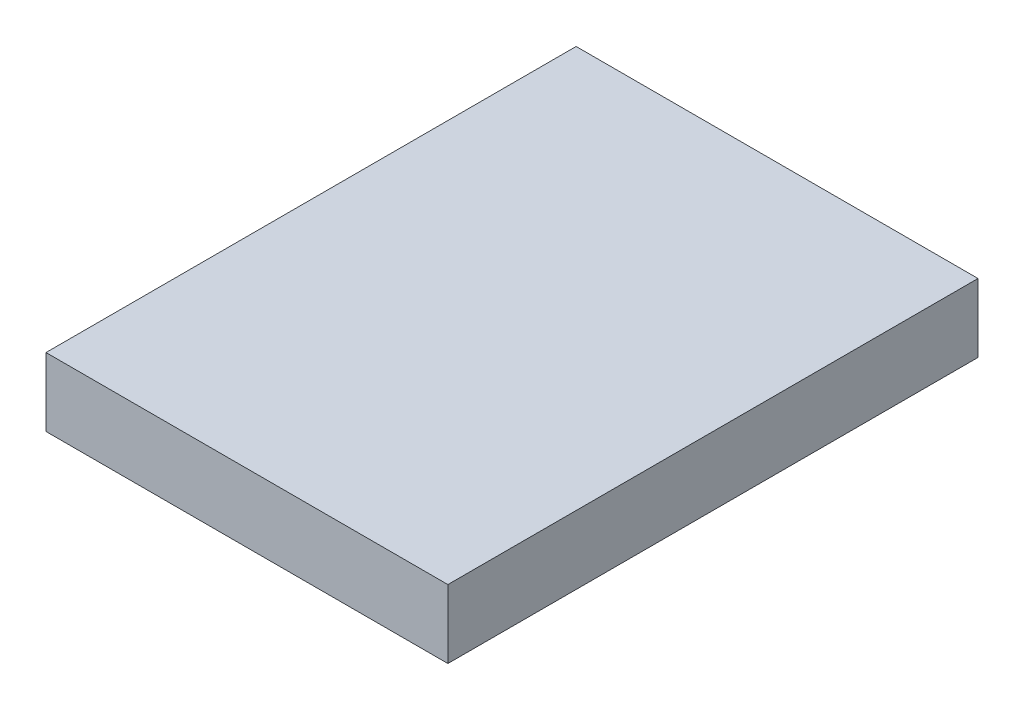
ISO-10303-21;
HEADER;
FILE_DESCRIPTION(('STEP AP214'),'2;1');
FILE_NAME('part.step','',(''),(''),'','','');
FILE_SCHEMA(('AUTOMOTIVE_DESIGN { 1 0 10303 214 1 1 1 1 }'));
ENDSEC;
DATA;
#1=APPLICATION_CONTEXT('core data for automotive mechanical design processes');
#2=APPLICATION_PROTOCOL_DEFINITION('international standard','automotive_design',2000,#1);
#3=PRODUCT_CONTEXT('',#1,'mechanical');
#4=PRODUCT('Part','Part','',(#3));
#5=PRODUCT_RELATED_PRODUCT_CATEGORY('part','',(#4));
#6=PRODUCT_DEFINITION_FORMATION('','',#4);
#7=PRODUCT_DEFINITION_CONTEXT('part definition',#1,'design');
#8=PRODUCT_DEFINITION('design','',#6,#7);
#9=PRODUCT_DEFINITION_SHAPE('','',#8);
#10=(LENGTH_UNIT() NAMED_UNIT(*) SI_UNIT(.MILLI.,.METRE.));
#11=(NAMED_UNIT(*) PLANE_ANGLE_UNIT() SI_UNIT($,.RADIAN.));
#12=(NAMED_UNIT(*) SI_UNIT($,.STERADIAN.) SOLID_ANGLE_UNIT());
#13=UNCERTAINTY_MEASURE_WITH_UNIT(LENGTH_MEASURE(1.E-05),#10,'distance_accuracy_value','');
#14=(GEOMETRIC_REPRESENTATION_CONTEXT(3) GLOBAL_UNCERTAINTY_ASSIGNED_CONTEXT((#13)) GLOBAL_UNIT_ASSIGNED_CONTEXT((#10,
#11,#12)) REPRESENTATION_CONTEXT('',''));
#15=CARTESIAN_POINT('',(0.,0.,0.));
#16=DIRECTION('',(0.,0.,1.));
#17=DIRECTION('',(1.,0.,0.));
#18=AXIS2_PLACEMENT_3D('',#15,#16,#17);
#19=CARTESIAN_POINT('',(0.,8.,0.));
#20=DIRECTION('',(1.,0.,0.));
#21=DIRECTION('',(0.,0.,-1.));
#22=AXIS2_PLACEMENT_3D('',#19,#20,#21);
#23=PLANE('',#22);
#24=DIRECTION('',(0.,0.,1.));
#25=VECTOR('',#24,1.);
#26=CARTESIAN_POINT('',(0.,0.,0.));
#27=LINE('',#26,#25);
#28=CARTESIAN_POINT('',(0.,0.,-62.));
#29=VERTEX_POINT('',#28);
#30=CARTESIAN_POINT('',(0.,0.,0.));
#31=VERTEX_POINT('',#30);
#32=EDGE_CURVE('E96',#29,#31,#27,.T.);
#33=ORIENTED_EDGE('',*,*,#32,.T.);
#34=DIRECTION('',(0.,-1.,0.));
#35=VECTOR('',#34,1.);
#36=CARTESIAN_POINT('',(0.,8.,0.));
#37=LINE('',#36,#35);
#38=CARTESIAN_POINT('',(0.,8.,0.));
#39=VERTEX_POINT('',#38);
#40=EDGE_CURVE('E11',#39,#31,#37,.T.);
#41=ORIENTED_EDGE('',*,*,#40,.F.);
#42=DIRECTION('',(0.,0.,1.));
#43=VECTOR('',#42,1.);
#44=CARTESIAN_POINT('',(0.,8.,0.));
#45=LINE('',#44,#43);
#46=CARTESIAN_POINT('',(0.,8.,-62.));
#47=VERTEX_POINT('',#46);
#48=EDGE_CURVE('E84',#47,#39,#45,.T.);
#49=ORIENTED_EDGE('',*,*,#48,.F.);
#50=DIRECTION('',(0.,-1.,0.));
#51=VECTOR('',#50,1.);
#52=CARTESIAN_POINT('',(0.,8.,-62.));
#53=LINE('',#52,#51);
#54=EDGE_CURVE('E92',#47,#29,#53,.T.);
#55=ORIENTED_EDGE('',*,*,#54,.T.);
#56=EDGE_LOOP('',(#33,#41,#49,#55));
#57=FACE_BOUND('',#56,.T.);
#58=ADVANCED_FACE('F33',(#57),#23,.F.);
#59=CARTESIAN_POINT('',(0.,8.,0.));
#60=DIRECTION('',(0.,0.,-1.));
#61=DIRECTION('',(-1.,0.,0.));
#62=AXIS2_PLACEMENT_3D('',#59,#60,#61);
#63=PLANE('',#62);
#64=DIRECTION('',(1.,0.,0.));
#65=VECTOR('',#64,1.);
#66=CARTESIAN_POINT('',(0.,0.,0.));
#67=LINE('',#66,#65);
#68=CARTESIAN_POINT('',(47.,0.,0.));
#69=VERTEX_POINT('',#68);
#70=EDGE_CURVE('E88',#31,#69,#67,.T.);
#71=ORIENTED_EDGE('',*,*,#70,.T.);
#72=DIRECTION('',(0.,-1.,0.));
#73=VECTOR('',#72,1.);
#74=CARTESIAN_POINT('',(47.,8.,0.));
#75=LINE('',#74,#73);
#76=CARTESIAN_POINT('',(47.,8.,0.));
#77=VERTEX_POINT('',#76);
#78=EDGE_CURVE('E41',#77,#69,#75,.T.);
#79=ORIENTED_EDGE('',*,*,#78,.F.);
#80=DIRECTION('',(1.,0.,0.));
#81=VECTOR('',#80,1.);
#82=CARTESIAN_POINT('',(0.,8.,0.));
#83=LINE('',#82,#81);
#84=EDGE_CURVE('E79',#39,#77,#83,.T.);
#85=ORIENTED_EDGE('',*,*,#84,.F.);
#86=ORIENTED_EDGE('',*,*,#40,.T.);
#87=EDGE_LOOP('',(#71,#79,#85,#86));
#88=FACE_BOUND('',#87,.T.);
#89=ADVANCED_FACE('F87',(#88),#63,.F.);
#90=CARTESIAN_POINT('',(47.,8.,0.));
#91=DIRECTION('',(-1.,0.,0.));
#92=DIRECTION('',(0.,0.,1.));
#93=AXIS2_PLACEMENT_3D('',#90,#91,#92);
#94=PLANE('',#93);
#95=DIRECTION('',(0.,0.,-1.));
#96=VECTOR('',#95,1.);
#97=CARTESIAN_POINT('',(47.,0.,0.));
#98=LINE('',#97,#96);
#99=CARTESIAN_POINT('',(47.,0.,-62.));
#100=VERTEX_POINT('',#99);
#101=EDGE_CURVE('E66',#69,#100,#98,.T.);
#102=ORIENTED_EDGE('',*,*,#101,.T.);
#103=DIRECTION('',(0.,-1.,0.));
#104=VECTOR('',#103,1.);
#105=CARTESIAN_POINT('',(47.,8.,-62.));
#106=LINE('',#105,#104);
#107=CARTESIAN_POINT('',(47.,8.,-62.));
#108=VERTEX_POINT('',#107);
#109=EDGE_CURVE('E89',#108,#100,#106,.T.);
#110=ORIENTED_EDGE('',*,*,#109,.F.);
#111=DIRECTION('',(0.,0.,-1.));
#112=VECTOR('',#111,1.);
#113=CARTESIAN_POINT('',(47.,8.,0.));
#114=LINE('',#113,#112);
#115=EDGE_CURVE('E82',#77,#108,#114,.T.);
#116=ORIENTED_EDGE('',*,*,#115,.F.);
#117=ORIENTED_EDGE('',*,*,#78,.T.);
#118=EDGE_LOOP('',(#102,#110,#116,#117));
#119=FACE_BOUND('',#118,.T.);
#120=ADVANCED_FACE('F90',(#119),#94,.F.);
#121=CARTESIAN_POINT('',(0.,8.,-62.));
#122=DIRECTION('',(0.,0.,1.));
#123=DIRECTION('',(1.,0.,0.));
#124=AXIS2_PLACEMENT_3D('',#121,#122,#123);
#125=PLANE('',#124);
#126=DIRECTION('',(-1.,0.,0.));
#127=VECTOR('',#126,1.);
#128=CARTESIAN_POINT('',(0.,0.,-62.));
#129=LINE('',#128,#127);
#130=EDGE_CURVE('E72',#100,#29,#129,.T.);
#131=ORIENTED_EDGE('',*,*,#130,.T.);
#132=ORIENTED_EDGE('',*,*,#54,.F.);
#133=DIRECTION('',(-1.,0.,0.));
#134=VECTOR('',#133,1.);
#135=CARTESIAN_POINT('',(0.,8.,-62.));
#136=LINE('',#135,#134);
#137=EDGE_CURVE('E49',#108,#47,#136,.T.);
#138=ORIENTED_EDGE('',*,*,#137,.F.);
#139=ORIENTED_EDGE('',*,*,#109,.T.);
#140=EDGE_LOOP('',(#131,#132,#138,#139));
#141=FACE_BOUND('',#140,.T.);
#142=ADVANCED_FACE('F103',(#141),#125,.F.);
#143=CARTESIAN_POINT('',(0.,8.,0.));
#144=DIRECTION('',(0.,-1.,0.));
#145=DIRECTION('',(0.,0.,-1.));
#146=AXIS2_PLACEMENT_3D('',#143,#144,#145);
#147=PLANE('',#146);
#148=ORIENTED_EDGE('',*,*,#48,.T.);
#149=ORIENTED_EDGE('',*,*,#84,.T.);
#150=ORIENTED_EDGE('',*,*,#115,.T.);
#151=ORIENTED_EDGE('',*,*,#137,.T.);
#152=EDGE_LOOP('',(#148,#149,#150,#151));
#153=FACE_BOUND('',#152,.T.);
#154=ADVANCED_FACE('F80',(#153),#147,.F.);
#155=CARTESIAN_POINT('',(0.,0.,0.));
#156=DIRECTION('',(0.,-1.,0.));
#157=DIRECTION('',(0.,0.,-1.));
#158=AXIS2_PLACEMENT_3D('',#155,#156,#157);
#159=PLANE('',#158);
#160=ORIENTED_EDGE('',*,*,#32,.F.);
#161=ORIENTED_EDGE('',*,*,#130,.F.);
#162=ORIENTED_EDGE('',*,*,#101,.F.);
#163=ORIENTED_EDGE('',*,*,#70,.F.);
#164=EDGE_LOOP('',(#160,#161,#162,#163));
#165=FACE_BOUND('',#164,.T.);
#166=ADVANCED_FACE('F106',(#165),#159,.T.);
#167=CLOSED_SHELL('',(#58,#89,#120,#142,#154,#166));
#168=MANIFOLD_SOLID_BREP('B2',#167);
#169=ADVANCED_BREP_SHAPE_REPRESENTATION('',(#18,#168),#14);
#170=SHAPE_DEFINITION_REPRESENTATION(#9,#169);
ENDSEC;
END-ISO-10303-21;
